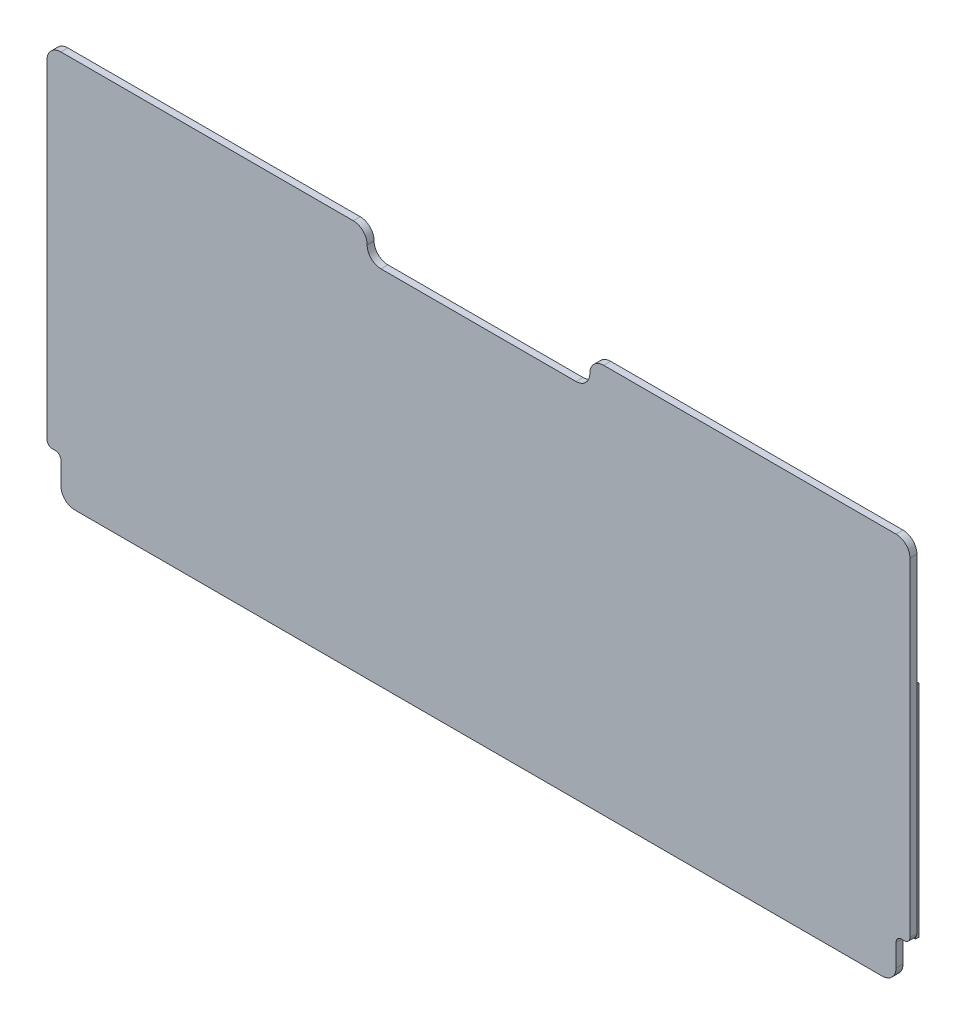
ISO-10303-21;
HEADER;
FILE_DESCRIPTION(('STEP AP214'),'2;1');
FILE_NAME('part.step','',(''),(''),'','','');
FILE_SCHEMA(('AUTOMOTIVE_DESIGN { 1 0 10303 214 1 1 1 1 }'));
ENDSEC;
DATA;
#1=APPLICATION_CONTEXT('core data for automotive mechanical design processes');
#2=APPLICATION_PROTOCOL_DEFINITION('international standard','automotive_design',2000,#1);
#3=PRODUCT_CONTEXT('',#1,'mechanical');
#4=PRODUCT('Part','Part','',(#3));
#5=PRODUCT_RELATED_PRODUCT_CATEGORY('part','',(#4));
#6=PRODUCT_DEFINITION_FORMATION('','',#4);
#7=PRODUCT_DEFINITION_CONTEXT('part definition',#1,'design');
#8=PRODUCT_DEFINITION('design','',#6,#7);
#9=PRODUCT_DEFINITION_SHAPE('','',#8);
#10=(LENGTH_UNIT() NAMED_UNIT(*) SI_UNIT(.MILLI.,.METRE.));
#11=(NAMED_UNIT(*) PLANE_ANGLE_UNIT() SI_UNIT($,.RADIAN.));
#12=(NAMED_UNIT(*) SI_UNIT($,.STERADIAN.) SOLID_ANGLE_UNIT());
#13=UNCERTAINTY_MEASURE_WITH_UNIT(LENGTH_MEASURE(1.E-05),#10,'distance_accuracy_value','');
#14=(GEOMETRIC_REPRESENTATION_CONTEXT(3) GLOBAL_UNCERTAINTY_ASSIGNED_CONTEXT((#13)) GLOBAL_UNIT_ASSIGNED_CONTEXT((#10,
#11,#12)) REPRESENTATION_CONTEXT('',''));
#15=CARTESIAN_POINT('',(0.,0.,0.));
#16=DIRECTION('',(0.,0.,1.));
#17=DIRECTION('',(1.,0.,0.));
#18=AXIS2_PLACEMENT_3D('',#15,#16,#17);
#19=CARTESIAN_POINT('',(194.31,21.59,0.));
#20=DIRECTION('',(0.,0.,1.));
#21=DIRECTION('',(1.,0.,0.));
#22=AXIS2_PLACEMENT_3D('',#19,#20,#21);
#23=PLANE('',#22);
#24=DIRECTION('',(-1.,0.,0.));
#25=VECTOR('',#24,1.);
#26=CARTESIAN_POINT('',(-184.785,19.0500000000001,0.));
#27=LINE('',#26,#25);
#28=CARTESIAN_POINT('',(-184.785,19.0500000000001,0.));
#29=VERTEX_POINT('',#28);
#30=CARTESIAN_POINT('',(-193.04,19.05,0.));
#31=VERTEX_POINT('',#30);
#32=EDGE_CURVE('E279',#29,#31,#27,.T.);
#33=ORIENTED_EDGE('',*,*,#32,.F.);
#34=DIRECTION('',(0.,-1.,0.));
#35=VECTOR('',#34,1.);
#36=CARTESIAN_POINT('',(-184.785,119.38,0.));
#37=LINE('',#36,#35);
#38=CARTESIAN_POINT('',(-184.785,119.38,0.));
#39=VERTEX_POINT('',#38);
#40=EDGE_CURVE('E273',#39,#29,#37,.T.);
#41=ORIENTED_EDGE('',*,*,#40,.F.);
#42=DIRECTION('',(1.,0.,0.));
#43=VECTOR('',#42,1.);
#44=CARTESIAN_POINT('',(-196.215,119.38,0.));
#45=LINE('',#44,#43);
#46=CARTESIAN_POINT('',(-196.215,119.38,0.));
#47=VERTEX_POINT('',#46);
#48=EDGE_CURVE('E256',#47,#39,#45,.T.);
#49=ORIENTED_EDGE('',*,*,#48,.F.);
#50=DIRECTION('',(0.,1.,0.));
#51=VECTOR('',#50,1.);
#52=CARTESIAN_POINT('',(-196.215,19.0500000000001,0.));
#53=LINE('',#52,#51);
#54=CARTESIAN_POINT('',(-196.215,19.909947917474,0.));
#55=VERTEX_POINT('',#54);
#56=EDGE_CURVE('E266',#55,#47,#53,.T.);
#57=ORIENTED_EDGE('',*,*,#56,.F.);
#58=CARTESIAN_POINT('',(-194.31,21.59,0.));
#59=DIRECTION('',(0.,0.,1.));
#60=DIRECTION('',(-1.,0.,0.));
#61=AXIS2_PLACEMENT_3D('',#58,#59,#60);
#62=CIRCLE('',#61,2.53999999999999);
#63=CARTESIAN_POINT('',(-196.85,21.59,0.));
#64=VERTEX_POINT('',#63);
#65=EDGE_CURVE('E401',#64,#55,#62,.T.);
#66=ORIENTED_EDGE('',*,*,#65,.F.);
#67=DIRECTION('',(0.,-1.,0.));
#68=VECTOR('',#67,1.);
#69=CARTESIAN_POINT('',(-196.85,171.45,0.));
#70=LINE('',#69,#68);
#71=CARTESIAN_POINT('',(-196.85,171.45,0.));
#72=VERTEX_POINT('',#71);
#73=EDGE_CURVE('E399',#72,#64,#70,.T.);
#74=ORIENTED_EDGE('',*,*,#73,.F.);
#75=CARTESIAN_POINT('',(-190.5,171.45,0.));
#76=DIRECTION('',(0.,0.,1.));
#77=DIRECTION('',(-1.,0.,0.));
#78=AXIS2_PLACEMENT_3D('',#75,#76,#77);
#79=CIRCLE('',#78,6.34999999999998);
#80=CARTESIAN_POINT('',(-190.5,177.8,0.));
#81=VERTEX_POINT('',#80);
#82=EDGE_CURVE('E397',#81,#72,#79,.T.);
#83=ORIENTED_EDGE('',*,*,#82,.F.);
#84=DIRECTION('',(-1.,0.,0.));
#85=VECTOR('',#84,1.);
#86=CARTESIAN_POINT('',(-190.5,177.8,0.));
#87=LINE('',#86,#85);
#88=CARTESIAN_POINT('',(-57.0901903426093,177.8,0.));
#89=VERTEX_POINT('',#88);
#90=EDGE_CURVE('E395',#89,#81,#87,.T.);
#91=ORIENTED_EDGE('',*,*,#90,.F.);
#92=CARTESIAN_POINT('',(-57.0901903426093,171.509809657391,0.));
#93=DIRECTION('',(0.,0.,1.));
#94=DIRECTION('',(1.,0.,0.));
#95=AXIS2_PLACEMENT_3D('',#92,#93,#94);
#96=CIRCLE('',#95,6.29019034260933);
#97=CARTESIAN_POINT('',(-50.8,171.509809657391,0.));
#98=VERTEX_POINT('',#97);
#99=EDGE_CURVE('E393',#98,#89,#96,.T.);
#100=ORIENTED_EDGE('',*,*,#99,.F.);
#101=DIRECTION('',(0.,1.,0.));
#102=VECTOR('',#101,1.);
#103=CARTESIAN_POINT('',(-50.8,171.509809657391,0.));
#104=LINE('',#103,#102);
#105=CARTESIAN_POINT('',(-50.8,171.390190342609,0.));
#106=VERTEX_POINT('',#105);
#107=EDGE_CURVE('E391',#106,#98,#104,.T.);
#108=ORIENTED_EDGE('',*,*,#107,.F.);
#109=CARTESIAN_POINT('',(-44.5098096573907,171.390190342609,0.));
#110=DIRECTION('',(0.,0.,-1.));
#111=DIRECTION('',(1.,0.,0.));
#112=AXIS2_PLACEMENT_3D('',#109,#110,#111);
#113=CIRCLE('',#112,6.29019034260933);
#114=CARTESIAN_POINT('',(-44.5098096573907,165.1,0.));
#115=VERTEX_POINT('',#114);
#116=EDGE_CURVE('E389',#115,#106,#113,.T.);
#117=ORIENTED_EDGE('',*,*,#116,.F.);
#118=DIRECTION('',(-1.,0.,0.));
#119=VECTOR('',#118,1.);
#120=CARTESIAN_POINT('',(-44.5098096573907,165.1,0.));
#121=LINE('',#120,#119);
#122=CARTESIAN_POINT('',(44.5098096573907,165.1,0.));
#123=VERTEX_POINT('',#122);
#124=EDGE_CURVE('E387',#123,#115,#121,.T.);
#125=ORIENTED_EDGE('',*,*,#124,.F.);
#126=CARTESIAN_POINT('',(44.5098096573907,171.390190342609,0.));
#127=DIRECTION('',(0.,0.,-1.));
#128=DIRECTION('',(1.,0.,0.));
#129=AXIS2_PLACEMENT_3D('',#126,#127,#128);
#130=CIRCLE('',#129,6.29019034260933);
#131=CARTESIAN_POINT('',(50.8,171.390190342609,0.));
#132=VERTEX_POINT('',#131);
#133=EDGE_CURVE('E385',#132,#123,#130,.T.);
#134=ORIENTED_EDGE('',*,*,#133,.F.);
#135=DIRECTION('',(0.,-1.,0.));
#136=VECTOR('',#135,1.);
#137=CARTESIAN_POINT('',(50.8,171.390190342609,0.));
#138=LINE('',#137,#136);
#139=CARTESIAN_POINT('',(50.8,171.509809657391,0.));
#140=VERTEX_POINT('',#139);
#141=EDGE_CURVE('E383',#140,#132,#138,.T.);
#142=ORIENTED_EDGE('',*,*,#141,.F.);
#143=CARTESIAN_POINT('',(57.0901903426093,171.509809657391,0.));
#144=DIRECTION('',(0.,0.,1.));
#145=DIRECTION('',(1.,0.,0.));
#146=AXIS2_PLACEMENT_3D('',#143,#144,#145);
#147=CIRCLE('',#146,6.29019034260933);
#148=CARTESIAN_POINT('',(57.0901903426093,177.8,0.));
#149=VERTEX_POINT('',#148);
#150=EDGE_CURVE('E381',#149,#140,#147,.T.);
#151=ORIENTED_EDGE('',*,*,#150,.F.);
#152=DIRECTION('',(-1.,0.,0.));
#153=VECTOR('',#152,1.);
#154=CARTESIAN_POINT('',(57.0901903426093,177.8,0.));
#155=LINE('',#154,#153);
#156=CARTESIAN_POINT('',(190.5,177.8,0.));
#157=VERTEX_POINT('',#156);
#158=EDGE_CURVE('E379',#157,#149,#155,.T.);
#159=ORIENTED_EDGE('',*,*,#158,.F.);
#160=CARTESIAN_POINT('',(190.5,171.45,0.));
#161=DIRECTION('',(0.,0.,1.));
#162=DIRECTION('',(1.,0.,0.));
#163=AXIS2_PLACEMENT_3D('',#160,#161,#162);
#164=CIRCLE('',#163,6.34999999999999);
#165=CARTESIAN_POINT('',(196.85,171.45,0.));
#166=VERTEX_POINT('',#165);
#167=EDGE_CURVE('E377',#166,#157,#164,.T.);
#168=ORIENTED_EDGE('',*,*,#167,.F.);
#169=DIRECTION('',(0.,1.,0.));
#170=VECTOR('',#169,1.);
#171=CARTESIAN_POINT('',(196.85,171.45,0.));
#172=LINE('',#171,#170);
#173=CARTESIAN_POINT('',(196.85,21.59,0.));
#174=VERTEX_POINT('',#173);
#175=EDGE_CURVE('E375',#174,#166,#172,.T.);
#176=ORIENTED_EDGE('',*,*,#175,.F.);
#177=CARTESIAN_POINT('',(194.31,21.59,0.));
#178=DIRECTION('',(0.,0.,1.));
#179=DIRECTION('',(1.,0.,0.));
#180=AXIS2_PLACEMENT_3D('',#177,#178,#179);
#181=CIRCLE('',#180,2.54000000000001);
#182=CARTESIAN_POINT('',(196.215,19.909947917474,0.));
#183=VERTEX_POINT('',#182);
#184=EDGE_CURVE('E320',#183,#174,#181,.T.);
#185=ORIENTED_EDGE('',*,*,#184,.F.);
#186=DIRECTION('',(0.,-1.,0.));
#187=VECTOR('',#186,1.);
#188=CARTESIAN_POINT('',(196.215,19.0500000000001,0.));
#189=LINE('',#188,#187);
#190=CARTESIAN_POINT('',(196.215,119.38,0.));
#191=VERTEX_POINT('',#190);
#192=EDGE_CURVE('E57',#191,#183,#189,.T.);
#193=ORIENTED_EDGE('',*,*,#192,.F.);
#194=DIRECTION('',(1.,0.,0.));
#195=VECTOR('',#194,1.);
#196=CARTESIAN_POINT('',(196.215,119.38,0.));
#197=LINE('',#196,#195);
#198=CARTESIAN_POINT('',(184.785,119.38,0.));
#199=VERTEX_POINT('',#198);
#200=EDGE_CURVE('E305',#199,#191,#197,.T.);
#201=ORIENTED_EDGE('',*,*,#200,.F.);
#202=DIRECTION('',(0.,1.,0.));
#203=VECTOR('',#202,1.);
#204=CARTESIAN_POINT('',(184.785,119.38,0.));
#205=LINE('',#204,#203);
#206=CARTESIAN_POINT('',(184.785,19.0500000000001,0.));
#207=VERTEX_POINT('',#206);
#208=EDGE_CURVE('E63',#207,#199,#205,.T.);
#209=ORIENTED_EDGE('',*,*,#208,.F.);
#210=DIRECTION('',(-1.,0.,0.));
#211=VECTOR('',#210,1.);
#212=CARTESIAN_POINT('',(184.785,19.0500000000001,0.));
#213=LINE('',#212,#211);
#214=CARTESIAN_POINT('',(193.04,19.05,0.));
#215=VERTEX_POINT('',#214);
#216=EDGE_CURVE('E11',#215,#207,#213,.T.);
#217=ORIENTED_EDGE('',*,*,#216,.F.);
#218=CARTESIAN_POINT('',(193.04,16.51,0.));
#219=DIRECTION('',(0.,0.,-1.));
#220=DIRECTION('',(1.,0.,0.));
#221=AXIS2_PLACEMENT_3D('',#218,#219,#220);
#222=CIRCLE('',#221,2.53999999999999);
#223=CARTESIAN_POINT('',(190.5,16.51,0.));
#224=VERTEX_POINT('',#223);
#225=EDGE_CURVE('E325',#224,#215,#222,.T.);
#226=ORIENTED_EDGE('',*,*,#225,.F.);
#227=DIRECTION('',(0.,1.,0.));
#228=VECTOR('',#227,1.);
#229=CARTESIAN_POINT('',(190.5,16.51,0.));
#230=LINE('',#229,#228);
#231=CARTESIAN_POINT('',(190.5,6.34999999999997,0.));
#232=VERTEX_POINT('',#231);
#233=EDGE_CURVE('E414',#232,#224,#230,.T.);
#234=ORIENTED_EDGE('',*,*,#233,.F.);
#235=CARTESIAN_POINT('',(184.15,6.34999999999997,0.));
#236=DIRECTION('',(0.,0.,1.));
#237=DIRECTION('',(1.,0.,0.));
#238=AXIS2_PLACEMENT_3D('',#235,#236,#237);
#239=CIRCLE('',#238,6.34999999999997);
#240=CARTESIAN_POINT('',(184.15,0.,0.));
#241=VERTEX_POINT('',#240);
#242=EDGE_CURVE('E412',#241,#232,#239,.T.);
#243=ORIENTED_EDGE('',*,*,#242,.F.);
#244=DIRECTION('',(1.,0.,0.));
#245=VECTOR('',#244,1.);
#246=CARTESIAN_POINT('',(-184.15,0.,0.));
#247=LINE('',#246,#245);
#248=CARTESIAN_POINT('',(-184.15,0.,0.));
#249=VERTEX_POINT('',#248);
#250=EDGE_CURVE('E410',#249,#241,#247,.T.);
#251=ORIENTED_EDGE('',*,*,#250,.F.);
#252=CARTESIAN_POINT('',(-184.15,6.34999999999997,0.));
#253=DIRECTION('',(0.,0.,1.));
#254=DIRECTION('',(1.,0.,0.));
#255=AXIS2_PLACEMENT_3D('',#252,#253,#254);
#256=CIRCLE('',#255,6.34999999999997);
#257=CARTESIAN_POINT('',(-190.5,6.34999999999997,0.));
#258=VERTEX_POINT('',#257);
#259=EDGE_CURVE('E408',#258,#249,#256,.T.);
#260=ORIENTED_EDGE('',*,*,#259,.F.);
#261=DIRECTION('',(0.,-1.,0.));
#262=VECTOR('',#261,1.);
#263=CARTESIAN_POINT('',(-190.5,16.51,0.));
#264=LINE('',#263,#262);
#265=CARTESIAN_POINT('',(-190.5,16.51,0.));
#266=VERTEX_POINT('',#265);
#267=EDGE_CURVE('E406',#266,#258,#264,.T.);
#268=ORIENTED_EDGE('',*,*,#267,.F.);
#269=CARTESIAN_POINT('',(-193.04,16.51,0.));
#270=DIRECTION('',(0.,0.,-1.));
#271=DIRECTION('',(-1.,0.,0.));
#272=AXIS2_PLACEMENT_3D('',#269,#270,#271);
#273=CIRCLE('',#272,2.53999999999999);
#274=EDGE_CURVE('E404',#31,#266,#273,.T.);
#275=ORIENTED_EDGE('',*,*,#274,.F.);
#276=EDGE_LOOP('',(#33,#41,#49,#57,#66,#74,#83,#91,#100,#108,#117,#125,#134,#142,#151,#159,#168,
#176,#185,#193,#201,#209,#217,#226,#234,#243,#251,#260,#268,#275));
#277=FACE_BOUND('',#276,.T.);
#278=ADVANCED_FACE('F40',(#277),#23,.F.);
#279=CARTESIAN_POINT('',(194.31,21.59,3.175));
#280=DIRECTION('',(0.,0.,-1.));
#281=DIRECTION('',(-1.,0.,0.));
#282=AXIS2_PLACEMENT_3D('',#279,#280,#281);
#283=CYLINDRICAL_SURFACE('',#282,2.54000000000001);
#284=CARTESIAN_POINT('',(194.31,19.05,0.));
#285=VERTEX_POINT('',#284);
#286=EDGE_CURVE('E372',#285,#183,#181,.T.);
#287=ORIENTED_EDGE('',*,*,#286,.T.);
#288=ORIENTED_EDGE('',*,*,#184,.T.);
#289=DIRECTION('',(0.,0.,-1.));
#290=VECTOR('',#289,1.);
#291=CARTESIAN_POINT('',(196.85,21.59,3.175));
#292=LINE('',#291,#290);
#293=CARTESIAN_POINT('',(196.85,21.59,3.175));
#294=VERTEX_POINT('',#293);
#295=EDGE_CURVE('E44',#294,#174,#292,.T.);
#296=ORIENTED_EDGE('',*,*,#295,.F.);
#297=CARTESIAN_POINT('',(194.31,21.59,3.175));
#298=DIRECTION('',(0.,0.,1.));
#299=DIRECTION('',(1.,0.,0.));
#300=AXIS2_PLACEMENT_3D('',#297,#298,#299);
#301=CIRCLE('',#300,2.54000000000001);
#302=CARTESIAN_POINT('',(194.31,19.05,3.175));
#303=VERTEX_POINT('',#302);
#304=EDGE_CURVE('E321',#303,#294,#301,.T.);
#305=ORIENTED_EDGE('',*,*,#304,.F.);
#306=DIRECTION('',(0.,0.,-1.));
#307=VECTOR('',#306,1.);
#308=CARTESIAN_POINT('',(194.31,19.05,3.175));
#309=LINE('',#308,#307);
#310=EDGE_CURVE('E371',#303,#285,#309,.T.);
#311=ORIENTED_EDGE('',*,*,#310,.T.);
#312=EDGE_LOOP('',(#287,#288,#296,#305,#311));
#313=FACE_BOUND('',#312,.T.);
#314=ADVANCED_FACE('F42',(#313),#283,.T.);
#315=CARTESIAN_POINT('',(196.85,171.45,3.175));
#316=DIRECTION('',(-1.,0.,0.));
#317=DIRECTION('',(0.,-1.,0.));
#318=AXIS2_PLACEMENT_3D('',#315,#316,#317);
#319=PLANE('',#318);
#320=ORIENTED_EDGE('',*,*,#175,.T.);
#321=DIRECTION('',(0.,0.,-1.));
#322=VECTOR('',#321,1.);
#323=CARTESIAN_POINT('',(196.85,171.45,3.175));
#324=LINE('',#323,#322);
#325=CARTESIAN_POINT('',(196.85,171.45,3.175));
#326=VERTEX_POINT('',#325);
#327=EDGE_CURVE('E481',#326,#166,#324,.T.);
#328=ORIENTED_EDGE('',*,*,#327,.F.);
#329=DIRECTION('',(0.,1.,0.));
#330=VECTOR('',#329,1.);
#331=CARTESIAN_POINT('',(196.85,171.45,3.175));
#332=LINE('',#331,#330);
#333=EDGE_CURVE('E324',#294,#326,#332,.T.);
#334=ORIENTED_EDGE('',*,*,#333,.F.);
#335=ORIENTED_EDGE('',*,*,#295,.T.);
#336=EDGE_LOOP('',(#320,#328,#334,#335));
#337=FACE_BOUND('',#336,.T.);
#338=ADVANCED_FACE('F490',(#337),#319,.F.);
#339=CARTESIAN_POINT('',(190.5,171.45,3.175));
#340=DIRECTION('',(0.,0.,-1.));
#341=DIRECTION('',(-1.,0.,0.));
#342=AXIS2_PLACEMENT_3D('',#339,#340,#341);
#343=CYLINDRICAL_SURFACE('',#342,6.34999999999999);
#344=ORIENTED_EDGE('',*,*,#167,.T.);
#345=DIRECTION('',(0.,0.,-1.));
#346=VECTOR('',#345,1.);
#347=CARTESIAN_POINT('',(190.5,177.8,3.175));
#348=LINE('',#347,#346);
#349=CARTESIAN_POINT('',(190.5,177.8,3.175));
#350=VERTEX_POINT('',#349);
#351=EDGE_CURVE('E479',#350,#157,#348,.T.);
#352=ORIENTED_EDGE('',*,*,#351,.F.);
#353=CARTESIAN_POINT('',(190.5,171.45,3.175));
#354=DIRECTION('',(0.,0.,1.));
#355=DIRECTION('',(1.,0.,0.));
#356=AXIS2_PLACEMENT_3D('',#353,#354,#355);
#357=CIRCLE('',#356,6.34999999999999);
#358=EDGE_CURVE('E327',#326,#350,#357,.T.);
#359=ORIENTED_EDGE('',*,*,#358,.F.);
#360=ORIENTED_EDGE('',*,*,#327,.T.);
#361=EDGE_LOOP('',(#344,#352,#359,#360));
#362=FACE_BOUND('',#361,.T.);
#363=ADVANCED_FACE('F499',(#362),#343,.T.);
#364=CARTESIAN_POINT('',(57.0901903426093,177.8,3.175));
#365=DIRECTION('',(0.,-1.,0.));
#366=DIRECTION('',(1.,0.,0.));
#367=AXIS2_PLACEMENT_3D('',#364,#365,#366);
#368=PLANE('',#367);
#369=ORIENTED_EDGE('',*,*,#158,.T.);
#370=DIRECTION('',(0.,0.,-1.));
#371=VECTOR('',#370,1.);
#372=CARTESIAN_POINT('',(57.0901903426093,177.8,3.175));
#373=LINE('',#372,#371);
#374=CARTESIAN_POINT('',(57.0901903426093,177.8,3.175));
#375=VERTEX_POINT('',#374);
#376=EDGE_CURVE('E476',#375,#149,#373,.T.);
#377=ORIENTED_EDGE('',*,*,#376,.F.);
#378=DIRECTION('',(-1.,0.,0.));
#379=VECTOR('',#378,1.);
#380=CARTESIAN_POINT('',(57.0901903426093,177.8,3.175));
#381=LINE('',#380,#379);
#382=EDGE_CURVE('E329',#350,#375,#381,.T.);
#383=ORIENTED_EDGE('',*,*,#382,.F.);
#384=ORIENTED_EDGE('',*,*,#351,.T.);
#385=EDGE_LOOP('',(#369,#377,#383,#384));
#386=FACE_BOUND('',#385,.T.);
#387=ADVANCED_FACE('F502',(#386),#368,.F.);
#388=CARTESIAN_POINT('',(57.0901903426093,171.509809657391,3.175));
#389=DIRECTION('',(0.,0.,-1.));
#390=DIRECTION('',(-1.,0.,0.));
#391=AXIS2_PLACEMENT_3D('',#388,#389,#390);
#392=CYLINDRICAL_SURFACE('',#391,6.29019034260933);
#393=ORIENTED_EDGE('',*,*,#150,.T.);
#394=DIRECTION('',(0.,0.,-1.));
#395=VECTOR('',#394,1.);
#396=CARTESIAN_POINT('',(50.8,171.509809657391,3.175));
#397=LINE('',#396,#395);
#398=CARTESIAN_POINT('',(50.8,171.509809657391,3.175));
#399=VERTEX_POINT('',#398);
#400=EDGE_CURVE('E473',#399,#140,#397,.T.);
#401=ORIENTED_EDGE('',*,*,#400,.F.);
#402=CARTESIAN_POINT('',(57.0901903426093,171.509809657391,3.175));
#403=DIRECTION('',(0.,0.,1.));
#404=DIRECTION('',(1.,0.,0.));
#405=AXIS2_PLACEMENT_3D('',#402,#403,#404);
#406=CIRCLE('',#405,6.29019034260933);
#407=EDGE_CURVE('E331',#375,#399,#406,.T.);
#408=ORIENTED_EDGE('',*,*,#407,.F.);
#409=ORIENTED_EDGE('',*,*,#376,.T.);
#410=EDGE_LOOP('',(#393,#401,#408,#409));
#411=FACE_BOUND('',#410,.T.);
#412=ADVANCED_FACE('F631',(#411),#392,.T.);
#413=CARTESIAN_POINT('',(50.8,171.390190342609,3.175));
#414=DIRECTION('',(1.,0.,0.));
#415=DIRECTION('',(0.,0.,-1.));
#416=AXIS2_PLACEMENT_3D('',#413,#414,#415);
#417=PLANE('',#416);
#418=ORIENTED_EDGE('',*,*,#141,.T.);
#419=DIRECTION('',(0.,0.,-1.));
#420=VECTOR('',#419,1.);
#421=CARTESIAN_POINT('',(50.8,171.390190342609,3.175));
#422=LINE('',#421,#420);
#423=CARTESIAN_POINT('',(50.8,171.390190342609,3.175));
#424=VERTEX_POINT('',#423);
#425=EDGE_CURVE('E470',#424,#132,#422,.T.);
#426=ORIENTED_EDGE('',*,*,#425,.F.);
#427=DIRECTION('',(0.,-1.,0.));
#428=VECTOR('',#427,1.);
#429=CARTESIAN_POINT('',(50.8,171.390190342609,3.175));
#430=LINE('',#429,#428);
#431=EDGE_CURVE('E333',#399,#424,#430,.T.);
#432=ORIENTED_EDGE('',*,*,#431,.F.);
#433=ORIENTED_EDGE('',*,*,#400,.T.);
#434=EDGE_LOOP('',(#418,#426,#432,#433));
#435=FACE_BOUND('',#434,.T.);
#436=ADVANCED_FACE('F629',(#435),#417,.F.);
#437=CARTESIAN_POINT('',(44.5098096573907,171.390190342609,3.175));
#438=DIRECTION('',(0.,0.,-1.));
#439=DIRECTION('',(-1.,0.,0.));
#440=AXIS2_PLACEMENT_3D('',#437,#438,#439);
#441=CYLINDRICAL_SURFACE('',#440,6.29019034260933);
#442=ORIENTED_EDGE('',*,*,#133,.T.);
#443=DIRECTION('',(0.,0.,-1.));
#444=VECTOR('',#443,1.);
#445=CARTESIAN_POINT('',(44.5098096573907,165.1,3.175));
#446=LINE('',#445,#444);
#447=CARTESIAN_POINT('',(44.5098096573907,165.1,3.175));
#448=VERTEX_POINT('',#447);
#449=EDGE_CURVE('E467',#448,#123,#446,.T.);
#450=ORIENTED_EDGE('',*,*,#449,.F.);
#451=CARTESIAN_POINT('',(44.5098096573907,171.390190342609,3.175));
#452=DIRECTION('',(0.,0.,-1.));
#453=DIRECTION('',(1.,0.,0.));
#454=AXIS2_PLACEMENT_3D('',#451,#452,#453);
#455=CIRCLE('',#454,6.29019034260933);
#456=EDGE_CURVE('E335',#424,#448,#455,.T.);
#457=ORIENTED_EDGE('',*,*,#456,.F.);
#458=ORIENTED_EDGE('',*,*,#425,.T.);
#459=EDGE_LOOP('',(#442,#450,#457,#458));
#460=FACE_BOUND('',#459,.T.);
#461=ADVANCED_FACE('F624',(#460),#441,.F.);
#462=CARTESIAN_POINT('',(-44.5098096573907,165.1,3.175));
#463=DIRECTION('',(0.,-1.,0.));
#464=DIRECTION('',(0.,0.,-1.));
#465=AXIS2_PLACEMENT_3D('',#462,#463,#464);
#466=PLANE('',#465);
#467=ORIENTED_EDGE('',*,*,#124,.T.);
#468=DIRECTION('',(0.,0.,-1.));
#469=VECTOR('',#468,1.);
#470=CARTESIAN_POINT('',(-44.5098096573907,165.1,3.175));
#471=LINE('',#470,#469);
#472=CARTESIAN_POINT('',(-44.5098096573907,165.1,3.175));
#473=VERTEX_POINT('',#472);
#474=EDGE_CURVE('E464',#473,#115,#471,.T.);
#475=ORIENTED_EDGE('',*,*,#474,.F.);
#476=DIRECTION('',(-1.,0.,0.));
#477=VECTOR('',#476,1.);
#478=CARTESIAN_POINT('',(-44.5098096573907,165.1,3.175));
#479=LINE('',#478,#477);
#480=EDGE_CURVE('E337',#448,#473,#479,.T.);
#481=ORIENTED_EDGE('',*,*,#480,.F.);
#482=ORIENTED_EDGE('',*,*,#449,.T.);
#483=EDGE_LOOP('',(#467,#475,#481,#482));
#484=FACE_BOUND('',#483,.T.);
#485=ADVANCED_FACE('F619',(#484),#466,.F.);
#486=CARTESIAN_POINT('',(-44.5098096573907,171.390190342609,3.175));
#487=DIRECTION('',(0.,0.,-1.));
#488=DIRECTION('',(-1.,0.,0.));
#489=AXIS2_PLACEMENT_3D('',#486,#487,#488);
#490=CYLINDRICAL_SURFACE('',#489,6.29019034260933);
#491=ORIENTED_EDGE('',*,*,#116,.T.);
#492=DIRECTION('',(0.,0.,-1.));
#493=VECTOR('',#492,1.);
#494=CARTESIAN_POINT('',(-50.8,171.390190342609,3.175));
#495=LINE('',#494,#493);
#496=CARTESIAN_POINT('',(-50.8,171.390190342609,3.175));
#497=VERTEX_POINT('',#496);
#498=EDGE_CURVE('E461',#497,#106,#495,.T.);
#499=ORIENTED_EDGE('',*,*,#498,.F.);
#500=CARTESIAN_POINT('',(-44.5098096573907,171.390190342609,3.175));
#501=DIRECTION('',(0.,0.,-1.));
#502=DIRECTION('',(1.,0.,0.));
#503=AXIS2_PLACEMENT_3D('',#500,#501,#502);
#504=CIRCLE('',#503,6.29019034260933);
#505=EDGE_CURVE('E339',#473,#497,#504,.T.);
#506=ORIENTED_EDGE('',*,*,#505,.F.);
#507=ORIENTED_EDGE('',*,*,#474,.T.);
#508=EDGE_LOOP('',(#491,#499,#506,#507));
#509=FACE_BOUND('',#508,.T.);
#510=ADVANCED_FACE('F615',(#509),#490,.F.);
#511=CARTESIAN_POINT('',(-50.8,171.509809657391,3.175));
#512=DIRECTION('',(-1.,0.,0.));
#513=DIRECTION('',(0.,0.,1.));
#514=AXIS2_PLACEMENT_3D('',#511,#512,#513);
#515=PLANE('',#514);
#516=ORIENTED_EDGE('',*,*,#107,.T.);
#517=DIRECTION('',(0.,0.,-1.));
#518=VECTOR('',#517,1.);
#519=CARTESIAN_POINT('',(-50.8,171.509809657391,3.175));
#520=LINE('',#519,#518);
#521=CARTESIAN_POINT('',(-50.8,171.509809657391,3.175));
#522=VERTEX_POINT('',#521);
#523=EDGE_CURVE('E458',#522,#98,#520,.T.);
#524=ORIENTED_EDGE('',*,*,#523,.F.);
#525=DIRECTION('',(0.,1.,0.));
#526=VECTOR('',#525,1.);
#527=CARTESIAN_POINT('',(-50.8,171.509809657391,3.175));
#528=LINE('',#527,#526);
#529=EDGE_CURVE('E341',#497,#522,#528,.T.);
#530=ORIENTED_EDGE('',*,*,#529,.F.);
#531=ORIENTED_EDGE('',*,*,#498,.T.);
#532=EDGE_LOOP('',(#516,#524,#530,#531));
#533=FACE_BOUND('',#532,.T.);
#534=ADVANCED_FACE('F610',(#533),#515,.F.);
#535=CARTESIAN_POINT('',(-57.0901903426093,171.509809657391,3.175));
#536=DIRECTION('',(0.,0.,-1.));
#537=DIRECTION('',(-1.,0.,0.));
#538=AXIS2_PLACEMENT_3D('',#535,#536,#537);
#539=CYLINDRICAL_SURFACE('',#538,6.29019034260933);
#540=ORIENTED_EDGE('',*,*,#99,.T.);
#541=DIRECTION('',(0.,0.,-1.));
#542=VECTOR('',#541,1.);
#543=CARTESIAN_POINT('',(-57.0901903426093,177.8,3.175));
#544=LINE('',#543,#542);
#545=CARTESIAN_POINT('',(-57.0901903426093,177.8,3.175));
#546=VERTEX_POINT('',#545);
#547=EDGE_CURVE('E455',#546,#89,#544,.T.);
#548=ORIENTED_EDGE('',*,*,#547,.F.);
#549=CARTESIAN_POINT('',(-57.0901903426093,171.509809657391,3.175));
#550=DIRECTION('',(0.,0.,1.));
#551=DIRECTION('',(1.,0.,0.));
#552=AXIS2_PLACEMENT_3D('',#549,#550,#551);
#553=CIRCLE('',#552,6.29019034260933);
#554=EDGE_CURVE('E343',#522,#546,#553,.T.);
#555=ORIENTED_EDGE('',*,*,#554,.F.);
#556=ORIENTED_EDGE('',*,*,#523,.T.);
#557=EDGE_LOOP('',(#540,#548,#555,#556));
#558=FACE_BOUND('',#557,.T.);
#559=ADVANCED_FACE('F604',(#558),#539,.T.);
#560=CARTESIAN_POINT('',(-190.5,177.8,3.175));
#561=DIRECTION('',(0.,-1.,0.));
#562=DIRECTION('',(1.,0.,0.));
#563=AXIS2_PLACEMENT_3D('',#560,#561,#562);
#564=PLANE('',#563);
#565=ORIENTED_EDGE('',*,*,#90,.T.);
#566=DIRECTION('',(0.,0.,-1.));
#567=VECTOR('',#566,1.);
#568=CARTESIAN_POINT('',(-190.5,177.8,3.175));
#569=LINE('',#568,#567);
#570=CARTESIAN_POINT('',(-190.5,177.8,3.175));
#571=VERTEX_POINT('',#570);
#572=EDGE_CURVE('E452',#571,#81,#569,.T.);
#573=ORIENTED_EDGE('',*,*,#572,.F.);
#574=DIRECTION('',(-1.,0.,0.));
#575=VECTOR('',#574,1.);
#576=CARTESIAN_POINT('',(-190.5,177.8,3.175));
#577=LINE('',#576,#575);
#578=EDGE_CURVE('E345',#546,#571,#577,.T.);
#579=ORIENTED_EDGE('',*,*,#578,.F.);
#580=ORIENTED_EDGE('',*,*,#547,.T.);
#581=EDGE_LOOP('',(#565,#573,#579,#580));
#582=FACE_BOUND('',#581,.T.);
#583=ADVANCED_FACE('F600',(#582),#564,.F.);
#584=CARTESIAN_POINT('',(-190.5,171.45,3.175));
#585=DIRECTION('',(0.,0.,-1.));
#586=DIRECTION('',(-1.,0.,0.));
#587=AXIS2_PLACEMENT_3D('',#584,#585,#586);
#588=CYLINDRICAL_SURFACE('',#587,6.34999999999998);
#589=ORIENTED_EDGE('',*,*,#82,.T.);
#590=DIRECTION('',(0.,0.,-1.));
#591=VECTOR('',#590,1.);
#592=CARTESIAN_POINT('',(-196.85,171.45,3.175));
#593=LINE('',#592,#591);
#594=CARTESIAN_POINT('',(-196.85,171.45,3.175));
#595=VERTEX_POINT('',#594);
#596=EDGE_CURVE('E449',#595,#72,#593,.T.);
#597=ORIENTED_EDGE('',*,*,#596,.F.);
#598=CARTESIAN_POINT('',(-190.5,171.45,3.175));
#599=DIRECTION('',(0.,0.,1.));
#600=DIRECTION('',(-1.,0.,0.));
#601=AXIS2_PLACEMENT_3D('',#598,#599,#600);
#602=CIRCLE('',#601,6.34999999999998);
#603=EDGE_CURVE('E347',#571,#595,#602,.T.);
#604=ORIENTED_EDGE('',*,*,#603,.F.);
#605=ORIENTED_EDGE('',*,*,#572,.T.);
#606=EDGE_LOOP('',(#589,#597,#604,#605));
#607=FACE_BOUND('',#606,.T.);
#608=ADVANCED_FACE('F595',(#607),#588,.T.);
#609=CARTESIAN_POINT('',(-196.85,171.45,3.175));
#610=DIRECTION('',(1.,0.,0.));
#611=DIRECTION('',(0.,1.,0.));
#612=AXIS2_PLACEMENT_3D('',#609,#610,#611);
#613=PLANE('',#612);
#614=ORIENTED_EDGE('',*,*,#73,.T.);
#615=DIRECTION('',(0.,0.,-1.));
#616=VECTOR('',#615,1.);
#617=CARTESIAN_POINT('',(-196.85,21.59,3.175));
#618=LINE('',#617,#616);
#619=CARTESIAN_POINT('',(-196.85,21.59,3.175));
#620=VERTEX_POINT('',#619);
#621=EDGE_CURVE('E446',#620,#64,#618,.T.);
#622=ORIENTED_EDGE('',*,*,#621,.F.);
#623=DIRECTION('',(0.,-1.,0.));
#624=VECTOR('',#623,1.);
#625=CARTESIAN_POINT('',(-196.85,171.45,3.175));
#626=LINE('',#625,#624);
#627=EDGE_CURVE('E349',#595,#620,#626,.T.);
#628=ORIENTED_EDGE('',*,*,#627,.F.);
#629=ORIENTED_EDGE('',*,*,#596,.T.);
#630=EDGE_LOOP('',(#614,#622,#628,#629));
#631=FACE_BOUND('',#630,.T.);
#632=ADVANCED_FACE('F589',(#631),#613,.F.);
#633=CARTESIAN_POINT('',(-194.31,21.59,3.175));
#634=DIRECTION('',(0.,0.,-1.));
#635=DIRECTION('',(-1.,0.,0.));
#636=AXIS2_PLACEMENT_3D('',#633,#634,#635);
#637=CYLINDRICAL_SURFACE('',#636,2.53999999999999);
#638=ORIENTED_EDGE('',*,*,#65,.T.);
#639=CARTESIAN_POINT('',(-194.31,21.59,0.));
#640=DIRECTION('',(0.,0.,-1.));
#641=DIRECTION('',(-1.,0.,0.));
#642=AXIS2_PLACEMENT_3D('',#639,#640,#641);
#643=CIRCLE('',#642,2.53999999999999);
#644=CARTESIAN_POINT('',(-194.31,19.0500000000001,0.));
#645=VERTEX_POINT('',#644);
#646=EDGE_CURVE('E280',#645,#55,#643,.T.);
#647=ORIENTED_EDGE('',*,*,#646,.F.);
#648=DIRECTION('',(0.,0.,-1.));
#649=VECTOR('',#648,1.);
#650=CARTESIAN_POINT('',(-194.31,19.05,3.175));
#651=LINE('',#650,#649);
#652=CARTESIAN_POINT('',(-194.31,19.05,3.175));
#653=VERTEX_POINT('',#652);
#654=EDGE_CURVE('E443',#653,#645,#651,.T.);
#655=ORIENTED_EDGE('',*,*,#654,.F.);
#656=CARTESIAN_POINT('',(-194.31,21.59,3.175));
#657=DIRECTION('',(0.,0.,1.));
#658=DIRECTION('',(-1.,0.,0.));
#659=AXIS2_PLACEMENT_3D('',#656,#657,#658);
#660=CIRCLE('',#659,2.53999999999999);
#661=EDGE_CURVE('E351',#620,#653,#660,.T.);
#662=ORIENTED_EDGE('',*,*,#661,.F.);
#663=ORIENTED_EDGE('',*,*,#621,.T.);
#664=EDGE_LOOP('',(#638,#647,#655,#662,#663));
#665=FACE_BOUND('',#664,.T.);
#666=ADVANCED_FACE('F583',(#665),#637,.T.);
#667=CARTESIAN_POINT('',(-194.31,19.05,3.175));
#668=DIRECTION('',(0.,1.,0.));
#669=DIRECTION('',(0.,0.,1.));
#670=AXIS2_PLACEMENT_3D('',#667,#668,#669);
#671=PLANE('',#670);
#672=ORIENTED_EDGE('',*,*,#654,.T.);
#673=CARTESIAN_POINT('',(-196.215,19.0500000000001,0.));
#674=VERTEX_POINT('',#673);
#675=EDGE_CURVE('E283',#645,#674,#27,.T.);
#676=ORIENTED_EDGE('',*,*,#675,.T.);
#677=DIRECTION('',(0.,0.,1.));
#678=VECTOR('',#677,1.);
#679=CARTESIAN_POINT('',(-196.215,19.0500000000001,-1.5875));
#680=LINE('',#679,#678);
#681=CARTESIAN_POINT('',(-196.215,19.0500000000001,-1.5875));
#682=VERTEX_POINT('',#681);
#683=EDGE_CURVE('E568',#682,#674,#680,.T.);
#684=ORIENTED_EDGE('',*,*,#683,.F.);
#685=DIRECTION('',(-1.,0.,0.));
#686=VECTOR('',#685,1.);
#687=CARTESIAN_POINT('',(-184.785,19.0500000000001,-1.5875));
#688=LINE('',#687,#686);
#689=CARTESIAN_POINT('',(-184.785,19.0500000000001,-1.5875));
#690=VERTEX_POINT('',#689);
#691=EDGE_CURVE('E290',#690,#682,#688,.T.);
#692=ORIENTED_EDGE('',*,*,#691,.F.);
#693=DIRECTION('',(0.,0.,1.));
#694=VECTOR('',#693,1.);
#695=CARTESIAN_POINT('',(-184.785,19.0500000000001,-1.5875));
#696=LINE('',#695,#694);
#697=EDGE_CURVE('E566',#690,#29,#696,.T.);
#698=ORIENTED_EDGE('',*,*,#697,.T.);
#699=ORIENTED_EDGE('',*,*,#32,.T.);
#700=DIRECTION('',(0.,0.,-1.));
#701=VECTOR('',#700,1.);
#702=CARTESIAN_POINT('',(-193.04,19.05,3.175));
#703=LINE('',#702,#701);
#704=CARTESIAN_POINT('',(-193.04,19.05,3.175));
#705=VERTEX_POINT('',#704);
#706=EDGE_CURVE('E440',#705,#31,#703,.T.);
#707=ORIENTED_EDGE('',*,*,#706,.F.);
#708=DIRECTION('',(1.,0.,0.));
#709=VECTOR('',#708,1.);
#710=CARTESIAN_POINT('',(-194.31,19.05,3.175));
#711=LINE('',#710,#709);
#712=EDGE_CURVE('E353',#653,#705,#711,.T.);
#713=ORIENTED_EDGE('',*,*,#712,.F.);
#714=EDGE_LOOP('',(#672,#676,#684,#692,#698,#699,#707,#713));
#715=FACE_BOUND('',#714,.T.);
#716=ADVANCED_FACE('F565',(#715),#671,.F.);
#717=CARTESIAN_POINT('',(-193.04,16.51,3.175));
#718=DIRECTION('',(0.,0.,-1.));
#719=DIRECTION('',(-1.,0.,0.));
#720=AXIS2_PLACEMENT_3D('',#717,#718,#719);
#721=CYLINDRICAL_SURFACE('',#720,2.53999999999999);
#722=ORIENTED_EDGE('',*,*,#274,.T.);
#723=DIRECTION('',(0.,0.,-1.));
#724=VECTOR('',#723,1.);
#725=CARTESIAN_POINT('',(-190.5,16.51,3.175));
#726=LINE('',#725,#724);
#727=CARTESIAN_POINT('',(-190.5,16.51,3.175));
#728=VERTEX_POINT('',#727);
#729=EDGE_CURVE('E437',#728,#266,#726,.T.);
#730=ORIENTED_EDGE('',*,*,#729,.F.);
#731=CARTESIAN_POINT('',(-193.04,16.51,3.175));
#732=DIRECTION('',(0.,0.,-1.));
#733=DIRECTION('',(-1.,0.,0.));
#734=AXIS2_PLACEMENT_3D('',#731,#732,#733);
#735=CIRCLE('',#734,2.53999999999999);
#736=EDGE_CURVE('E355',#705,#728,#735,.T.);
#737=ORIENTED_EDGE('',*,*,#736,.F.);
#738=ORIENTED_EDGE('',*,*,#706,.T.);
#739=EDGE_LOOP('',(#722,#730,#737,#738));
#740=FACE_BOUND('',#739,.T.);
#741=ADVANCED_FACE('F561',(#740),#721,.F.);
#742=CARTESIAN_POINT('',(-190.5,16.51,3.175));
#743=DIRECTION('',(1.,0.,0.));
#744=DIRECTION('',(0.,1.,0.));
#745=AXIS2_PLACEMENT_3D('',#742,#743,#744);
#746=PLANE('',#745);
#747=ORIENTED_EDGE('',*,*,#267,.T.);
#748=DIRECTION('',(0.,0.,-1.));
#749=VECTOR('',#748,1.);
#750=CARTESIAN_POINT('',(-190.5,6.34999999999997,3.175));
#751=LINE('',#750,#749);
#752=CARTESIAN_POINT('',(-190.5,6.34999999999997,3.175));
#753=VERTEX_POINT('',#752);
#754=EDGE_CURVE('E434',#753,#258,#751,.T.);
#755=ORIENTED_EDGE('',*,*,#754,.F.);
#756=DIRECTION('',(0.,-1.,0.));
#757=VECTOR('',#756,1.);
#758=CARTESIAN_POINT('',(-190.5,16.51,3.175));
#759=LINE('',#758,#757);
#760=EDGE_CURVE('E357',#728,#753,#759,.T.);
#761=ORIENTED_EDGE('',*,*,#760,.F.);
#762=ORIENTED_EDGE('',*,*,#729,.T.);
#763=EDGE_LOOP('',(#747,#755,#761,#762));
#764=FACE_BOUND('',#763,.T.);
#765=ADVANCED_FACE('F556',(#764),#746,.F.);
#766=CARTESIAN_POINT('',(-184.15,6.34999999999997,3.175));
#767=DIRECTION('',(0.,0.,-1.));
#768=DIRECTION('',(-1.,0.,0.));
#769=AXIS2_PLACEMENT_3D('',#766,#767,#768);
#770=CYLINDRICAL_SURFACE('',#769,6.34999999999997);
#771=ORIENTED_EDGE('',*,*,#259,.T.);
#772=DIRECTION('',(0.,0.,-1.));
#773=VECTOR('',#772,1.);
#774=CARTESIAN_POINT('',(-184.15,0.,3.175));
#775=LINE('',#774,#773);
#776=CARTESIAN_POINT('',(-184.15,0.,3.175));
#777=VERTEX_POINT('',#776);
#778=EDGE_CURVE('E431',#777,#249,#775,.T.);
#779=ORIENTED_EDGE('',*,*,#778,.F.);
#780=CARTESIAN_POINT('',(-184.15,6.34999999999997,3.175));
#781=DIRECTION('',(0.,0.,1.));
#782=DIRECTION('',(1.,0.,0.));
#783=AXIS2_PLACEMENT_3D('',#780,#781,#782);
#784=CIRCLE('',#783,6.34999999999997);
#785=EDGE_CURVE('E359',#753,#777,#784,.T.);
#786=ORIENTED_EDGE('',*,*,#785,.F.);
#787=ORIENTED_EDGE('',*,*,#754,.T.);
#788=EDGE_LOOP('',(#771,#779,#786,#787));
#789=FACE_BOUND('',#788,.T.);
#790=ADVANCED_FACE('F552',(#789),#770,.T.);
#791=CARTESIAN_POINT('',(-184.15,0.,3.175));
#792=DIRECTION('',(0.,1.,0.));
#793=DIRECTION('',(0.,0.,1.));
#794=AXIS2_PLACEMENT_3D('',#791,#792,#793);
#795=PLANE('',#794);
#796=ORIENTED_EDGE('',*,*,#250,.T.);
#797=DIRECTION('',(0.,0.,-1.));
#798=VECTOR('',#797,1.);
#799=CARTESIAN_POINT('',(184.15,0.,3.175));
#800=LINE('',#799,#798);
#801=CARTESIAN_POINT('',(184.15,0.,3.175));
#802=VERTEX_POINT('',#801);
#803=EDGE_CURVE('E428',#802,#241,#800,.T.);
#804=ORIENTED_EDGE('',*,*,#803,.F.);
#805=DIRECTION('',(1.,0.,0.));
#806=VECTOR('',#805,1.);
#807=CARTESIAN_POINT('',(-184.15,0.,3.175));
#808=LINE('',#807,#806);
#809=EDGE_CURVE('E361',#777,#802,#808,.T.);
#810=ORIENTED_EDGE('',*,*,#809,.F.);
#811=ORIENTED_EDGE('',*,*,#778,.T.);
#812=EDGE_LOOP('',(#796,#804,#810,#811));
#813=FACE_BOUND('',#812,.T.);
#814=ADVANCED_FACE('F548',(#813),#795,.F.);
#815=CARTESIAN_POINT('',(184.15,6.34999999999997,3.175));
#816=DIRECTION('',(0.,0.,-1.));
#817=DIRECTION('',(-1.,0.,0.));
#818=AXIS2_PLACEMENT_3D('',#815,#816,#817);
#819=CYLINDRICAL_SURFACE('',#818,6.34999999999997);
#820=ORIENTED_EDGE('',*,*,#242,.T.);
#821=DIRECTION('',(0.,0.,-1.));
#822=VECTOR('',#821,1.);
#823=CARTESIAN_POINT('',(190.5,6.34999999999997,3.175));
#824=LINE('',#823,#822);
#825=CARTESIAN_POINT('',(190.5,6.34999999999997,3.175));
#826=VERTEX_POINT('',#825);
#827=EDGE_CURVE('E425',#826,#232,#824,.T.);
#828=ORIENTED_EDGE('',*,*,#827,.F.);
#829=CARTESIAN_POINT('',(184.15,6.34999999999997,3.175));
#830=DIRECTION('',(0.,0.,1.));
#831=DIRECTION('',(1.,0.,0.));
#832=AXIS2_PLACEMENT_3D('',#829,#830,#831);
#833=CIRCLE('',#832,6.34999999999997);
#834=EDGE_CURVE('E363',#802,#826,#833,.T.);
#835=ORIENTED_EDGE('',*,*,#834,.F.);
#836=ORIENTED_EDGE('',*,*,#803,.T.);
#837=EDGE_LOOP('',(#820,#828,#835,#836));
#838=FACE_BOUND('',#837,.T.);
#839=ADVANCED_FACE('F543',(#838),#819,.T.);
#840=CARTESIAN_POINT('',(190.5,16.51,3.175));
#841=DIRECTION('',(-1.,0.,0.));
#842=DIRECTION('',(0.,-1.,0.));
#843=AXIS2_PLACEMENT_3D('',#840,#841,#842);
#844=PLANE('',#843);
#845=ORIENTED_EDGE('',*,*,#233,.T.);
#846=DIRECTION('',(0.,0.,-1.));
#847=VECTOR('',#846,1.);
#848=CARTESIAN_POINT('',(190.5,16.51,3.175));
#849=LINE('',#848,#847);
#850=CARTESIAN_POINT('',(190.5,16.51,3.175));
#851=VERTEX_POINT('',#850);
#852=EDGE_CURVE('E422',#851,#224,#849,.T.);
#853=ORIENTED_EDGE('',*,*,#852,.F.);
#854=DIRECTION('',(0.,1.,0.));
#855=VECTOR('',#854,1.);
#856=CARTESIAN_POINT('',(190.5,16.51,3.175));
#857=LINE('',#856,#855);
#858=EDGE_CURVE('E365',#826,#851,#857,.T.);
#859=ORIENTED_EDGE('',*,*,#858,.F.);
#860=ORIENTED_EDGE('',*,*,#827,.T.);
#861=EDGE_LOOP('',(#845,#853,#859,#860));
#862=FACE_BOUND('',#861,.T.);
#863=ADVANCED_FACE('F537',(#862),#844,.F.);
#864=CARTESIAN_POINT('',(193.04,16.51,3.175));
#865=DIRECTION('',(0.,0.,-1.));
#866=DIRECTION('',(-1.,0.,0.));
#867=AXIS2_PLACEMENT_3D('',#864,#865,#866);
#868=CYLINDRICAL_SURFACE('',#867,2.53999999999999);
#869=ORIENTED_EDGE('',*,*,#225,.T.);
#870=DIRECTION('',(0.,0.,-1.));
#871=VECTOR('',#870,1.);
#872=CARTESIAN_POINT('',(193.04,19.05,3.175));
#873=LINE('',#872,#871);
#874=CARTESIAN_POINT('',(193.04,19.05,3.175));
#875=VERTEX_POINT('',#874);
#876=EDGE_CURVE('E419',#875,#215,#873,.T.);
#877=ORIENTED_EDGE('',*,*,#876,.F.);
#878=CARTESIAN_POINT('',(193.04,16.51,3.175));
#879=DIRECTION('',(0.,0.,-1.));
#880=DIRECTION('',(1.,0.,0.));
#881=AXIS2_PLACEMENT_3D('',#878,#879,#880);
#882=CIRCLE('',#881,2.53999999999999);
#883=EDGE_CURVE('E367',#851,#875,#882,.T.);
#884=ORIENTED_EDGE('',*,*,#883,.F.);
#885=ORIENTED_EDGE('',*,*,#852,.T.);
#886=EDGE_LOOP('',(#869,#877,#884,#885));
#887=FACE_BOUND('',#886,.T.);
#888=ADVANCED_FACE('F533',(#887),#868,.F.);
#889=CARTESIAN_POINT('',(194.31,19.05,3.175));
#890=DIRECTION('',(0.,1.,0.));
#891=DIRECTION('',(0.,0.,1.));
#892=AXIS2_PLACEMENT_3D('',#889,#890,#891);
#893=PLANE('',#892);
#894=ORIENTED_EDGE('',*,*,#876,.T.);
#895=ORIENTED_EDGE('',*,*,#216,.T.);
#896=DIRECTION('',(0.,0.,1.));
#897=VECTOR('',#896,1.);
#898=CARTESIAN_POINT('',(184.785,19.0500000000001,-1.5875));
#899=LINE('',#898,#897);
#900=CARTESIAN_POINT('',(184.785,19.0500000000001,-1.5875));
#901=VERTEX_POINT('',#900);
#902=EDGE_CURVE('E317',#901,#207,#899,.T.);
#903=ORIENTED_EDGE('',*,*,#902,.F.);
#904=DIRECTION('',(-1.,0.,0.));
#905=VECTOR('',#904,1.);
#906=CARTESIAN_POINT('',(184.785,19.0500000000001,-1.5875));
#907=LINE('',#906,#905);
#908=CARTESIAN_POINT('',(196.215,19.0500000000001,-1.5875));
#909=VERTEX_POINT('',#908);
#910=EDGE_CURVE('E293',#909,#901,#907,.T.);
#911=ORIENTED_EDGE('',*,*,#910,.F.);
#912=DIRECTION('',(0.,0.,1.));
#913=VECTOR('',#912,1.);
#914=CARTESIAN_POINT('',(196.215,19.0500000000001,-1.5875));
#915=LINE('',#914,#913);
#916=CARTESIAN_POINT('',(196.215,19.0500000000001,0.));
#917=VERTEX_POINT('',#916);
#918=EDGE_CURVE('E301',#909,#917,#915,.T.);
#919=ORIENTED_EDGE('',*,*,#918,.T.);
#920=EDGE_CURVE('E50',#917,#285,#213,.T.);
#921=ORIENTED_EDGE('',*,*,#920,.T.);
#922=ORIENTED_EDGE('',*,*,#310,.F.);
#923=DIRECTION('',(1.,0.,0.));
#924=VECTOR('',#923,1.);
#925=CARTESIAN_POINT('',(194.31,19.05,3.175));
#926=LINE('',#925,#924);
#927=EDGE_CURVE('E369',#875,#303,#926,.T.);
#928=ORIENTED_EDGE('',*,*,#927,.F.);
#929=EDGE_LOOP('',(#894,#895,#903,#911,#919,#921,#922,#928));
#930=FACE_BOUND('',#929,.T.);
#931=ADVANCED_FACE('F513',(#930),#893,.F.);
#932=CARTESIAN_POINT('',(194.31,21.59,3.175));
#933=DIRECTION('',(0.,0.,1.));
#934=DIRECTION('',(1.,0.,0.));
#935=AXIS2_PLACEMENT_3D('',#932,#933,#934);
#936=PLANE('',#935);
#937=ORIENTED_EDGE('',*,*,#304,.T.);
#938=ORIENTED_EDGE('',*,*,#333,.T.);
#939=ORIENTED_EDGE('',*,*,#358,.T.);
#940=ORIENTED_EDGE('',*,*,#382,.T.);
#941=ORIENTED_EDGE('',*,*,#407,.T.);
#942=ORIENTED_EDGE('',*,*,#431,.T.);
#943=ORIENTED_EDGE('',*,*,#456,.T.);
#944=ORIENTED_EDGE('',*,*,#480,.T.);
#945=ORIENTED_EDGE('',*,*,#505,.T.);
#946=ORIENTED_EDGE('',*,*,#529,.T.);
#947=ORIENTED_EDGE('',*,*,#554,.T.);
#948=ORIENTED_EDGE('',*,*,#578,.T.);
#949=ORIENTED_EDGE('',*,*,#603,.T.);
#950=ORIENTED_EDGE('',*,*,#627,.T.);
#951=ORIENTED_EDGE('',*,*,#661,.T.);
#952=ORIENTED_EDGE('',*,*,#712,.T.);
#953=ORIENTED_EDGE('',*,*,#736,.T.);
#954=ORIENTED_EDGE('',*,*,#760,.T.);
#955=ORIENTED_EDGE('',*,*,#785,.T.);
#956=ORIENTED_EDGE('',*,*,#809,.T.);
#957=ORIENTED_EDGE('',*,*,#834,.T.);
#958=ORIENTED_EDGE('',*,*,#858,.T.);
#959=ORIENTED_EDGE('',*,*,#883,.T.);
#960=ORIENTED_EDGE('',*,*,#927,.T.);
#961=EDGE_LOOP('',(#937,#938,#939,#940,#941,#942,#943,#944,#945,#946,#947,#948,#949,#950,#951,
#952,#953,#954,#955,#956,#957,#958,#959,#960));
#962=FACE_BOUND('',#961,.T.);
#963=ADVANCED_FACE('F506',(#962),#936,.T.);
#964=CARTESIAN_POINT('',(0.,0.,0.));
#965=DIRECTION('',(0.,0.,1.));
#966=DIRECTION('',(1.,0.,0.));
#967=AXIS2_PLACEMENT_3D('',#964,#965,#966);
#968=PLANE('',#967);
#969=ORIENTED_EDGE('',*,*,#286,.F.);
#970=ORIENTED_EDGE('',*,*,#920,.F.);
#971=EDGE_CURVE('E307',#183,#917,#189,.T.);
#972=ORIENTED_EDGE('',*,*,#971,.F.);
#973=EDGE_LOOP('',(#969,#970,#972));
#974=FACE_BOUND('',#973,.T.);
#975=ADVANCED_FACE('F516',(#974),#968,.T.);
#976=CARTESIAN_POINT('',(184.785,119.38,-1.5875));
#977=DIRECTION('',(1.,0.,0.));
#978=DIRECTION('',(0.,1.,0.));
#979=AXIS2_PLACEMENT_3D('',#976,#977,#978);
#980=PLANE('',#979);
#981=ORIENTED_EDGE('',*,*,#208,.T.);
#982=DIRECTION('',(0.,0.,1.));
#983=VECTOR('',#982,1.);
#984=CARTESIAN_POINT('',(184.785,119.38,-1.5875));
#985=LINE('',#984,#983);
#986=CARTESIAN_POINT('',(184.785,119.38,-1.5875));
#987=VERTEX_POINT('',#986);
#988=EDGE_CURVE('E314',#987,#199,#985,.T.);
#989=ORIENTED_EDGE('',*,*,#988,.F.);
#990=DIRECTION('',(0.,1.,0.));
#991=VECTOR('',#990,1.);
#992=CARTESIAN_POINT('',(184.785,119.38,-1.5875));
#993=LINE('',#992,#991);
#994=EDGE_CURVE('E296',#901,#987,#993,.T.);
#995=ORIENTED_EDGE('',*,*,#994,.F.);
#996=ORIENTED_EDGE('',*,*,#902,.T.);
#997=EDGE_LOOP('',(#981,#989,#995,#996));
#998=FACE_BOUND('',#997,.T.);
#999=ADVANCED_FACE('F527',(#998),#980,.F.);
#1000=CARTESIAN_POINT('',(196.215,119.38,-1.5875));
#1001=DIRECTION('',(0.,-1.,0.));
#1002=DIRECTION('',(0.,0.,-1.));
#1003=AXIS2_PLACEMENT_3D('',#1000,#1001,#1002);
#1004=PLANE('',#1003);
#1005=ORIENTED_EDGE('',*,*,#200,.T.);
#1006=DIRECTION('',(0.,0.,1.));
#1007=VECTOR('',#1006,1.);
#1008=CARTESIAN_POINT('',(196.215,119.38,-1.5875));
#1009=LINE('',#1008,#1007);
#1010=CARTESIAN_POINT('',(196.215,119.38,-1.5875));
#1011=VERTEX_POINT('',#1010);
#1012=EDGE_CURVE('E311',#1011,#191,#1009,.T.);
#1013=ORIENTED_EDGE('',*,*,#1012,.F.);
#1014=DIRECTION('',(1.,0.,0.));
#1015=VECTOR('',#1014,1.);
#1016=CARTESIAN_POINT('',(196.215,119.38,-1.5875));
#1017=LINE('',#1016,#1015);
#1018=EDGE_CURVE('E298',#987,#1011,#1017,.T.);
#1019=ORIENTED_EDGE('',*,*,#1018,.F.);
#1020=ORIENTED_EDGE('',*,*,#988,.T.);
#1021=EDGE_LOOP('',(#1005,#1013,#1019,#1020));
#1022=FACE_BOUND('',#1021,.T.);
#1023=ADVANCED_FACE('F524',(#1022),#1004,.F.);
#1024=CARTESIAN_POINT('',(196.215,19.0500000000001,-1.5875));
#1025=DIRECTION('',(-1.,0.,0.));
#1026=DIRECTION('',(0.,0.,1.));
#1027=AXIS2_PLACEMENT_3D('',#1024,#1025,#1026);
#1028=PLANE('',#1027);
#1029=ORIENTED_EDGE('',*,*,#192,.T.);
#1030=ORIENTED_EDGE('',*,*,#971,.T.);
#1031=ORIENTED_EDGE('',*,*,#918,.F.);
#1032=DIRECTION('',(0.,-1.,0.));
#1033=VECTOR('',#1032,1.);
#1034=CARTESIAN_POINT('',(196.215,19.0500000000001,-1.5875));
#1035=LINE('',#1034,#1033);
#1036=EDGE_CURVE('E300',#1011,#909,#1035,.T.);
#1037=ORIENTED_EDGE('',*,*,#1036,.F.);
#1038=ORIENTED_EDGE('',*,*,#1012,.T.);
#1039=EDGE_LOOP('',(#1029,#1030,#1031,#1037,#1038));
#1040=FACE_BOUND('',#1039,.T.);
#1041=ADVANCED_FACE('F519',(#1040),#1028,.F.);
#1042=CARTESIAN_POINT('',(0.,0.,-1.5875));
#1043=DIRECTION('',(0.,0.,1.));
#1044=DIRECTION('',(1.,0.,0.));
#1045=AXIS2_PLACEMENT_3D('',#1042,#1043,#1044);
#1046=PLANE('',#1045);
#1047=ORIENTED_EDGE('',*,*,#910,.T.);
#1048=ORIENTED_EDGE('',*,*,#994,.T.);
#1049=ORIENTED_EDGE('',*,*,#1018,.T.);
#1050=ORIENTED_EDGE('',*,*,#1036,.T.);
#1051=EDGE_LOOP('',(#1047,#1048,#1049,#1050));
#1052=FACE_BOUND('',#1051,.T.);
#1053=ADVANCED_FACE('F784',(#1052),#1046,.F.);
#1054=CARTESIAN_POINT('',(0.,0.,0.));
#1055=DIRECTION('',(0.,0.,-1.));
#1056=DIRECTION('',(-1.,0.,0.));
#1057=AXIS2_PLACEMENT_3D('',#1054,#1055,#1056);
#1058=PLANE('',#1057);
#1059=ORIENTED_EDGE('',*,*,#675,.F.);
#1060=ORIENTED_EDGE('',*,*,#646,.T.);
#1061=EDGE_CURVE('E573',#674,#55,#53,.T.);
#1062=ORIENTED_EDGE('',*,*,#1061,.F.);
#1063=EDGE_LOOP('',(#1059,#1060,#1062));
#1064=FACE_BOUND('',#1063,.T.);
#1065=ADVANCED_FACE('F791',(#1064),#1058,.F.);
#1066=CARTESIAN_POINT('',(-184.785,119.38,-1.5875));
#1067=DIRECTION('',(-1.,0.,0.));
#1068=DIRECTION('',(0.,-1.,0.));
#1069=AXIS2_PLACEMENT_3D('',#1066,#1067,#1068);
#1070=PLANE('',#1069);
#1071=ORIENTED_EDGE('',*,*,#40,.T.);
#1072=ORIENTED_EDGE('',*,*,#697,.F.);
#1073=DIRECTION('',(0.,-1.,0.));
#1074=VECTOR('',#1073,1.);
#1075=CARTESIAN_POINT('',(-184.785,119.38,-1.5875));
#1076=LINE('',#1075,#1074);
#1077=CARTESIAN_POINT('',(-184.785,119.38,-1.5875));
#1078=VERTEX_POINT('',#1077);
#1079=EDGE_CURVE('E267',#1078,#690,#1076,.T.);
#1080=ORIENTED_EDGE('',*,*,#1079,.F.);
#1081=DIRECTION('',(0.,0.,1.));
#1082=VECTOR('',#1081,1.);
#1083=CARTESIAN_POINT('',(-184.785,119.38,-1.5875));
#1084=LINE('',#1083,#1082);
#1085=EDGE_CURVE('E260',#1078,#39,#1084,.T.);
#1086=ORIENTED_EDGE('',*,*,#1085,.T.);
#1087=EDGE_LOOP('',(#1071,#1072,#1080,#1086));
#1088=FACE_BOUND('',#1087,.T.);
#1089=ADVANCED_FACE('F271',(#1088),#1070,.F.);
#1090=CARTESIAN_POINT('',(-196.215,19.0500000000001,-1.5875));
#1091=DIRECTION('',(1.,0.,0.));
#1092=DIRECTION('',(0.,0.,-1.));
#1093=AXIS2_PLACEMENT_3D('',#1090,#1091,#1092);
#1094=PLANE('',#1093);
#1095=ORIENTED_EDGE('',*,*,#1061,.T.);
#1096=ORIENTED_EDGE('',*,*,#56,.T.);
#1097=DIRECTION('',(0.,0.,1.));
#1098=VECTOR('',#1097,1.);
#1099=CARTESIAN_POINT('',(-196.215,119.38,-1.5875));
#1100=LINE('',#1099,#1098);
#1101=CARTESIAN_POINT('',(-196.215,119.38,-1.5875));
#1102=VERTEX_POINT('',#1101);
#1103=EDGE_CURVE('E263',#1102,#47,#1100,.T.);
#1104=ORIENTED_EDGE('',*,*,#1103,.F.);
#1105=DIRECTION('',(0.,1.,0.));
#1106=VECTOR('',#1105,1.);
#1107=CARTESIAN_POINT('',(-196.215,19.0500000000001,-1.5875));
#1108=LINE('',#1107,#1106);
#1109=EDGE_CURVE('E288',#682,#1102,#1108,.T.);
#1110=ORIENTED_EDGE('',*,*,#1109,.F.);
#1111=ORIENTED_EDGE('',*,*,#683,.T.);
#1112=EDGE_LOOP('',(#1095,#1096,#1104,#1110,#1111));
#1113=FACE_BOUND('',#1112,.T.);
#1114=ADVANCED_FACE('F577',(#1113),#1094,.F.);
#1115=CARTESIAN_POINT('',(-196.215,119.38,-1.5875));
#1116=DIRECTION('',(0.,-1.,0.));
#1117=DIRECTION('',(0.,0.,-1.));
#1118=AXIS2_PLACEMENT_3D('',#1115,#1116,#1117);
#1119=PLANE('',#1118);
#1120=ORIENTED_EDGE('',*,*,#48,.T.);
#1121=ORIENTED_EDGE('',*,*,#1085,.F.);
#1122=DIRECTION('',(1.,0.,0.));
#1123=VECTOR('',#1122,1.);
#1124=CARTESIAN_POINT('',(-196.215,119.38,-1.5875));
#1125=LINE('',#1124,#1123);
#1126=EDGE_CURVE('E276',#1102,#1078,#1125,.T.);
#1127=ORIENTED_EDGE('',*,*,#1126,.F.);
#1128=ORIENTED_EDGE('',*,*,#1103,.T.);
#1129=EDGE_LOOP('',(#1120,#1121,#1127,#1128));
#1130=FACE_BOUND('',#1129,.T.);
#1131=ADVANCED_FACE('F258',(#1130),#1119,.F.);
#1132=CARTESIAN_POINT('',(0.,0.,-1.5875));
#1133=DIRECTION('',(0.,0.,-1.));
#1134=DIRECTION('',(-1.,0.,0.));
#1135=AXIS2_PLACEMENT_3D('',#1132,#1133,#1134);
#1136=PLANE('',#1135);
#1137=ORIENTED_EDGE('',*,*,#1079,.T.);
#1138=ORIENTED_EDGE('',*,*,#691,.T.);
#1139=ORIENTED_EDGE('',*,*,#1109,.T.);
#1140=ORIENTED_EDGE('',*,*,#1126,.T.);
#1141=EDGE_LOOP('',(#1137,#1138,#1139,#1140));
#1142=FACE_BOUND('',#1141,.T.);
#1143=ADVANCED_FACE('F818',(#1142),#1136,.T.);
#1144=CLOSED_SHELL('',(#278,#314,#338,#363,#387,#412,#436,#461,#485,#510,#534,#559,#583,#608,
#632,#666,#716,#741,#765,#790,#814,#839,#863,#888,#931,#963,#975,#999,#1023,#1041,#1053,#1065,
#1089,#1114,#1131,#1143));
#1145=MANIFOLD_SOLID_BREP('B2',#1144);
#1146=ADVANCED_BREP_SHAPE_REPRESENTATION('',(#18,#1145),#14);
#1147=SHAPE_DEFINITION_REPRESENTATION(#9,#1146);
ENDSEC;
END-ISO-10303-21;
